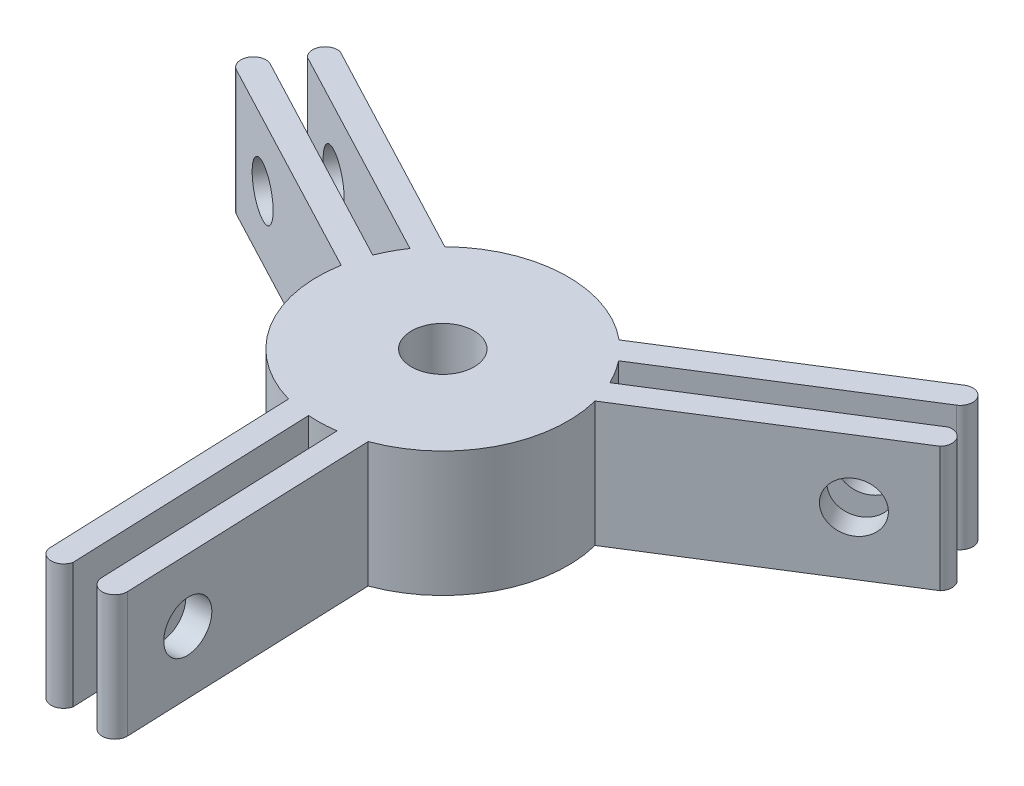
ISO-10303-21;
HEADER;
FILE_DESCRIPTION(('STEP AP214'),'2;1');
FILE_NAME('part.step','',(''),(''),'','','');
FILE_SCHEMA(('AUTOMOTIVE_DESIGN { 1 0 10303 214 1 1 1 1 }'));
ENDSEC;
DATA;
#1=APPLICATION_CONTEXT('core data for automotive mechanical design processes');
#2=APPLICATION_PROTOCOL_DEFINITION('international standard','automotive_design',2000,#1);
#3=PRODUCT_CONTEXT('',#1,'mechanical');
#4=PRODUCT('Part','Part','',(#3));
#5=PRODUCT_RELATED_PRODUCT_CATEGORY('part','',(#4));
#6=PRODUCT_DEFINITION_FORMATION('','',#4);
#7=PRODUCT_DEFINITION_CONTEXT('part definition',#1,'design');
#8=PRODUCT_DEFINITION('design','',#6,#7);
#9=PRODUCT_DEFINITION_SHAPE('','',#8);
#10=(LENGTH_UNIT() NAMED_UNIT(*) SI_UNIT(.MILLI.,.METRE.));
#11=(NAMED_UNIT(*) PLANE_ANGLE_UNIT() SI_UNIT($,.RADIAN.));
#12=(NAMED_UNIT(*) SI_UNIT($,.STERADIAN.) SOLID_ANGLE_UNIT());
#13=UNCERTAINTY_MEASURE_WITH_UNIT(LENGTH_MEASURE(1.E-05),#10,'distance_accuracy_value','');
#14=(GEOMETRIC_REPRESENTATION_CONTEXT(3) GLOBAL_UNCERTAINTY_ASSIGNED_CONTEXT((#13)) GLOBAL_UNIT_ASSIGNED_CONTEXT((#10,
#11,#12)) REPRESENTATION_CONTEXT('',''));
#15=CARTESIAN_POINT('',(0.,0.,0.));
#16=DIRECTION('',(0.,0.,1.));
#17=DIRECTION('',(1.,0.,0.));
#18=AXIS2_PLACEMENT_3D('',#15,#16,#17);
#19=CARTESIAN_POINT('',(0.,10.,0.));
#20=DIRECTION('',(0.,1.,0.));
#21=DIRECTION('',(0.,0.,1.));
#22=AXIS2_PLACEMENT_3D('',#19,#20,#21);
#23=PLANE('',#22);
#24=CARTESIAN_POINT('',(0.,10.,0.));
#25=DIRECTION('',(0.,1.,0.));
#26=DIRECTION('',(0.,0.,1.));
#27=AXIS2_PLACEMENT_3D('',#24,#25,#26);
#28=CIRCLE('',#27,10.);
#29=CARTESIAN_POINT('',(9.01148587106745,10.,-4.33510350459499));
#30=VERTEX_POINT('',#29);
#31=CARTESIAN_POINT('',(7.84546468512186,10.,-6.20070027291319));
#32=VERTEX_POINT('',#31);
#33=EDGE_CURVE('E272',#30,#32,#28,.T.);
#34=ORIENTED_EDGE('',*,*,#33,.T.);
#35=DIRECTION('',(0.846174424298782,0.,-0.532906036429149));
#36=VECTOR('',#35,1.);
#37=CARTESIAN_POINT('',(7.84546468512186,10.,-6.20070027291319));
#38=LINE('',#37,#36);
#39=CARTESIAN_POINT('',(24.4096415204676,10.,-16.6325327303295));
#40=VERTEX_POINT('',#39);
#41=EDGE_CURVE('E140',#32,#40,#38,.T.);
#42=ORIENTED_EDGE('',*,*,#41,.T.);
#43=CARTESIAN_POINT('',(23.8767354840384,10.,-17.4787071546283));
#44=DIRECTION('',(0.,1.,0.));
#45=DIRECTION('',(0.,0.,1.));
#46=AXIS2_PLACEMENT_3D('',#43,#44,#45);
#47=CIRCLE('',#46,1.);
#48=CARTESIAN_POINT('',(23.3438294476093,10.,-18.3248815789271));
#49=VERTEX_POINT('',#48);
#50=EDGE_CURVE('E335',#40,#49,#47,.T.);
#51=ORIENTED_EDGE('',*,*,#50,.T.);
#52=DIRECTION('',(-0.846174424298782,0.,0.532906036429149));
#53=VECTOR('',#52,1.);
#54=CARTESIAN_POINT('',(6.42034096163365,10.,-7.6667608503441));
#55=LINE('',#54,#53);
#56=CARTESIAN_POINT('',(6.42034096163365,10.,-7.6667608503441));
#57=VERTEX_POINT('',#56);
#58=EDGE_CURVE('E354',#49,#57,#55,.T.);
#59=ORIENTED_EDGE('',*,*,#58,.T.);
#60=CARTESIAN_POINT('',(0.,10.,0.));
#61=DIRECTION('',(0.,1.,0.));
#62=DIRECTION('',(0.,0.,1.));
#63=AXIS2_PLACEMENT_3D('',#60,#61,#62);
#64=CIRCLE('',#63,10.);
#65=CARTESIAN_POINT('',(-6.99010809505121,10.,-7.15111101993945));
#66=VERTEX_POINT('',#65);
#67=EDGE_CURVE('E351',#57,#66,#64,.T.);
#68=ORIENTED_EDGE('',*,*,#67,.T.);
#69=DIRECTION('',(-0.88459737752711,0.,-0.466355529260842));
#70=VECTOR('',#69,1.);
#71=CARTESIAN_POINT('',(-6.99010809505122,10.,-7.15111101993945));
#72=LINE('',#71,#70);
#73=CARTESIAN_POINT('',(-24.6820556455925,10.,-16.4782216051558));
#74=VERTEX_POINT('',#73);
#75=EDGE_CURVE('E353',#66,#74,#72,.T.);
#76=ORIENTED_EDGE('',*,*,#75,.T.);
#77=CARTESIAN_POINT('',(-24.9037683563406,10.,-15.5031095736985));
#78=DIRECTION('',(0.,1.,0.));
#79=DIRECTION('',(0.,0.,-1.));
#80=AXIS2_PLACEMENT_3D('',#77,#78,#79);
#81=CIRCLE('',#80,1.);
#82=CARTESIAN_POINT('',(-25.5830344696015,10.,-14.7692175193912));
#83=VERTEX_POINT('',#82);
#84=EDGE_CURVE('E356',#74,#83,#81,.T.);
#85=ORIENTED_EDGE('',*,*,#84,.T.);
#86=DIRECTION('',(0.88459737752711,0.,0.466355529260842));
#87=VECTOR('',#86,1.);
#88=CARTESIAN_POINT('',(-8.26005269854793,10.,-5.63662393789146));
#89=LINE('',#88,#87);
#90=CARTESIAN_POINT('',(-8.26005269854793,10.,-5.63662393789146));
#91=VERTEX_POINT('',#90);
#92=EDGE_CURVE('E362',#83,#91,#89,.T.);
#93=ORIENTED_EDGE('',*,*,#92,.T.);
#94=CARTESIAN_POINT('',(0.,10.,0.));
#95=DIRECTION('',(0.,1.,0.));
#96=DIRECTION('',(0.,0.,1.));
#97=AXIS2_PLACEMENT_3D('',#94,#95,#96);
#98=CIRCLE('',#97,10.);
#99=CARTESIAN_POINT('',(-9.29269630015686,10.,-3.69402158535262));
#100=VERTEX_POINT('',#99);
#101=EDGE_CURVE('E364',#91,#100,#98,.T.);
#102=ORIENTED_EDGE('',*,*,#101,.T.);
#103=DIRECTION('',(-0.88459737752711,0.,-0.466355529260842));
#104=VECTOR('',#103,1.);
#105=CARTESIAN_POINT('',(-9.29269630015686,10.,-3.69402158535262));
#106=LINE('',#105,#104);
#107=CARTESIAN_POINT('',(-26.6090166339753,10.,-12.8231032888316));
#108=VERTEX_POINT('',#107);
#109=EDGE_CURVE('E366',#100,#108,#106,.T.);
#110=ORIENTED_EDGE('',*,*,#109,.T.);
#111=CARTESIAN_POINT('',(-27.0753721632362,10.,-11.9385059113045));
#112=DIRECTION('',(0.,1.,0.));
#113=DIRECTION('',(0.,0.,1.));
#114=AXIS2_PLACEMENT_3D('',#111,#112,#113);
#115=CIRCLE('',#114,1.);
#116=CARTESIAN_POINT('',(-27.541727692497,10.,-11.0539085337773));
#117=VERTEX_POINT('',#116);
#118=EDGE_CURVE('E368',#108,#117,#115,.T.);
#119=ORIENTED_EDGE('',*,*,#118,.T.);
#120=DIRECTION('',(0.88459737752711,0.,0.466355529260842));
#121=VECTOR('',#120,1.);
#122=CARTESIAN_POINT('',(-9.8497801419548,10.,-1.7267979485605));
#123=LINE('',#122,#121);
#124=CARTESIAN_POINT('',(-9.8497801419548,10.,-1.7267979485605));
#125=VERTEX_POINT('',#124);
#126=EDGE_CURVE('E370',#117,#125,#123,.T.);
#127=ORIENTED_EDGE('',*,*,#126,.T.);
#128=CARTESIAN_POINT('',(0.,10.,0.));
#129=DIRECTION('',(0.,1.,0.));
#130=DIRECTION('',(0.,0.,1.));
#131=AXIS2_PLACEMENT_3D('',#128,#129,#130);
#132=CIRCLE('',#131,10.);
#133=CARTESIAN_POINT('',(-2.69798976102481,10.,9.62916669548333));
#134=VERTEX_POINT('',#133);
#135=EDGE_CURVE('E372',#125,#134,#132,.T.);
#136=ORIENTED_EDGE('',*,*,#135,.T.);
#137=DIRECTION('',(0.0384229532283287,0.,0.999261565689992));
#138=VECTOR('',#137,1.);
#139=CARTESIAN_POINT('',(-2.69798976102481,10.,9.62916669548333));
#140=LINE('',#139,#138);
#141=CARTESIAN_POINT('',(-1.92953069645827,10.,29.6143980092821));
#142=VERTEX_POINT('',#141);
#143=EDGE_CURVE('E374',#134,#142,#140,.T.);
#144=ORIENTED_EDGE('',*,*,#143,.T.);
#145=CARTESIAN_POINT('',(-0.974202550306361,10.,29.3188508334032));
#146=DIRECTION('',(0.,1.,0.));
#147=DIRECTION('',(0.,0.,-1.));
#148=AXIS2_PLACEMENT_3D('',#145,#146,#147);
#149=CIRCLE('',#148,0.999999999999999);
#150=CARTESIAN_POINT('',(0.000999668989778838,10.,29.5401665162634));
#151=VERTEX_POINT('',#150);
#152=EDGE_CURVE('E376',#142,#151,#149,.T.);
#153=ORIENTED_EDGE('',*,*,#152,.T.);
#154=DIRECTION('',(-0.0384229532283282,0.,-0.999261565689992));
#155=VECTOR('',#154,1.);
#156=CARTESIAN_POINT('',(-0.751433172519515,10.,9.97172744248644));
#157=LINE('',#156,#155);
#158=CARTESIAN_POINT('',(-0.751433172519515,10.,9.97172744248644));
#159=VERTEX_POINT('',#158);
#160=EDGE_CURVE('E378',#151,#159,#157,.T.);
#161=ORIENTED_EDGE('',*,*,#160,.T.);
#162=CARTESIAN_POINT('',(0.,10.,0.));
#163=DIRECTION('',(0.,1.,0.));
#164=DIRECTION('',(0.,0.,1.));
#165=AXIS2_PLACEMENT_3D('',#162,#163,#164);
#166=CIRCLE('',#165,10.);
#167=CARTESIAN_POINT('',(1.44723161503499,10.,9.89472185826581));
#168=VERTEX_POINT('',#167);
#169=EDGE_CURVE('E380',#159,#168,#166,.T.);
#170=ORIENTED_EDGE('',*,*,#169,.T.);
#171=DIRECTION('',(0.0384229532283283,0.,0.999261565689992));
#172=VECTOR('',#171,1.);
#173=CARTESIAN_POINT('',(1.44723161503499,10.,9.89472185826581));
#174=LINE('',#173,#172);
#175=CARTESIAN_POINT('',(2.19937511350774,10.,29.4556360191611));
#176=VERTEX_POINT('',#175);
#177=EDGE_CURVE('E382',#168,#176,#174,.T.);
#178=ORIENTED_EDGE('',*,*,#177,.T.);
#179=CARTESIAN_POINT('',(3.19863667919775,10.,29.4172130659328));
#180=DIRECTION('',(0.,1.,0.));
#181=DIRECTION('',(0.,0.,1.));
#182=AXIS2_PLACEMENT_3D('',#179,#180,#181);
#183=CIRCLE('',#182,1.);
#184=CARTESIAN_POINT('',(4.19789824488775,10.,29.3787901127044));
#185=VERTEX_POINT('',#184);
#186=EDGE_CURVE('E384',#176,#185,#183,.T.);
#187=ORIENTED_EDGE('',*,*,#186,.T.);
#188=DIRECTION('',(-0.0384229532283283,0.,-0.999261565689992));
#189=VECTOR('',#188,1.);
#190=CARTESIAN_POINT('',(3.42943918032116,10.,9.3935587989046));
#191=LINE('',#190,#189);
#192=CARTESIAN_POINT('',(3.42943918032116,10.,9.3935587989046));
#193=VERTEX_POINT('',#192);
#194=EDGE_CURVE('E386',#185,#193,#191,.T.);
#195=ORIENTED_EDGE('',*,*,#194,.T.);
#196=CARTESIAN_POINT('',(0.,10.,0.));
#197=DIRECTION('',(0.,1.,0.));
#198=DIRECTION('',(0.,0.,1.));
#199=AXIS2_PLACEMENT_3D('',#196,#197,#198);
#200=CIRCLE('',#199,10.);
#201=CARTESIAN_POINT('',(9.68809785607602,10.,-2.47805567554387));
#202=VERTEX_POINT('',#201);
#203=EDGE_CURVE('E207',#193,#202,#200,.T.);
#204=ORIENTED_EDGE('',*,*,#203,.T.);
#205=DIRECTION('',(0.846174424298781,0.,-0.53290603642915));
#206=VECTOR('',#205,1.);
#207=CARTESIAN_POINT('',(9.68809785607602,10.,-2.47805567554387));
#208=LINE('',#207,#206);
#209=CARTESIAN_POINT('',(26.6115863420508,10.,-13.1361764041263));
#210=VERTEX_POINT('',#209);
#211=EDGE_CURVE('E201',#202,#210,#208,.T.);
#212=ORIENTED_EDGE('',*,*,#211,.T.);
#213=CARTESIAN_POINT('',(25.8779709066469,10.,-13.8157412597047));
#214=DIRECTION('',(0.,1.,0.));
#215=DIRECTION('',(0.,0.,-1.));
#216=AXIS2_PLACEMENT_3D('',#213,#214,#215);
#217=CIRCLE('',#216,1.);
#218=CARTESIAN_POINT('',(25.5820348006117,10.,-14.7709489968722));
#219=VERTEX_POINT('',#218);
#220=EDGE_CURVE('E205',#210,#219,#217,.T.);
#221=ORIENTED_EDGE('',*,*,#220,.T.);
#222=DIRECTION('',(-0.846174424298781,0.,0.532906036429149));
#223=VECTOR('',#222,1.);
#224=CARTESIAN_POINT('',(9.01148587106745,10.,-4.33510350459499));
#225=LINE('',#224,#223);
#226=EDGE_CURVE('E49',#219,#30,#225,.T.);
#227=ORIENTED_EDGE('',*,*,#226,.T.);
#228=EDGE_LOOP('',(#34,#42,#51,#59,#68,#76,#85,#93,#102,#110,#119,#127,#136,#144,#153,#161,#170,
#178,#187,#195,#204,#212,#221,#227));
#229=FACE_BOUND('',#228,.T.);
#230=CARTESIAN_POINT('',(0.,10.,0.));
#231=DIRECTION('',(0.,1.,0.));
#232=DIRECTION('',(0.,0.,1.));
#233=AXIS2_PLACEMENT_3D('',#230,#231,#232);
#234=CIRCLE('',#233,2.5);
#235=CARTESIAN_POINT('',(0.,10.,2.5));
#236=VERTEX_POINT('',#235);
#237=EDGE_CURVE('E229',#236,#236,#234,.T.);
#238=ORIENTED_EDGE('',*,*,#237,.F.);
#239=EDGE_LOOP('',(#238));
#240=FACE_BOUND('',#239,.T.);
#241=ADVANCED_FACE('F32',(#229,#240),#23,.T.);
#242=CARTESIAN_POINT('',(0.,0.,0.));
#243=DIRECTION('',(0.,1.,0.));
#244=DIRECTION('',(0.,0.,1.));
#245=AXIS2_PLACEMENT_3D('',#242,#243,#244);
#246=PLANE('',#245);
#247=CARTESIAN_POINT('',(0.,0.,0.));
#248=DIRECTION('',(0.,1.,0.));
#249=DIRECTION('',(0.,0.,1.));
#250=AXIS2_PLACEMENT_3D('',#247,#248,#249);
#251=CIRCLE('',#250,10.);
#252=CARTESIAN_POINT('',(9.01148587106745,0.,-4.33510350459499));
#253=VERTEX_POINT('',#252);
#254=CARTESIAN_POINT('',(7.84546468512186,0.,-6.20070027291319));
#255=VERTEX_POINT('',#254);
#256=EDGE_CURVE('E225',#253,#255,#251,.T.);
#257=ORIENTED_EDGE('',*,*,#256,.F.);
#258=DIRECTION('',(-0.846174424298781,0.,0.532906036429149));
#259=VECTOR('',#258,1.);
#260=CARTESIAN_POINT('',(9.01148587106745,0.,-4.33510350459499));
#261=LINE('',#260,#259);
#262=CARTESIAN_POINT('',(25.5820348006117,0.,-14.7709489968722));
#263=VERTEX_POINT('',#262);
#264=EDGE_CURVE('E132',#263,#253,#261,.T.);
#265=ORIENTED_EDGE('',*,*,#264,.F.);
#266=CARTESIAN_POINT('',(25.8779709066469,0.,-13.8157412597047));
#267=DIRECTION('',(0.,1.,0.));
#268=DIRECTION('',(0.,0.,-1.));
#269=AXIS2_PLACEMENT_3D('',#266,#267,#268);
#270=CIRCLE('',#269,1.);
#271=CARTESIAN_POINT('',(26.6115863420508,0.,-13.1361764041263));
#272=VERTEX_POINT('',#271);
#273=EDGE_CURVE('E126',#272,#263,#270,.T.);
#274=ORIENTED_EDGE('',*,*,#273,.F.);
#275=DIRECTION('',(0.846174424298781,0.,-0.53290603642915));
#276=VECTOR('',#275,1.);
#277=CARTESIAN_POINT('',(9.68809785607602,0.,-2.47805567554387));
#278=LINE('',#277,#276);
#279=CARTESIAN_POINT('',(9.68809785607602,0.,-2.47805567554387));
#280=VERTEX_POINT('',#279);
#281=EDGE_CURVE('E215',#280,#272,#278,.T.);
#282=ORIENTED_EDGE('',*,*,#281,.F.);
#283=CARTESIAN_POINT('',(0.,0.,0.));
#284=DIRECTION('',(0.,1.,0.));
#285=DIRECTION('',(0.,0.,1.));
#286=AXIS2_PLACEMENT_3D('',#283,#284,#285);
#287=CIRCLE('',#286,10.);
#288=CARTESIAN_POINT('',(3.42943918032116,0.,9.3935587989046));
#289=VERTEX_POINT('',#288);
#290=EDGE_CURVE('E267',#289,#280,#287,.T.);
#291=ORIENTED_EDGE('',*,*,#290,.F.);
#292=DIRECTION('',(-0.0384229532283283,0.,-0.999261565689992));
#293=VECTOR('',#292,1.);
#294=CARTESIAN_POINT('',(3.42943918032116,0.,9.3935587989046));
#295=LINE('',#294,#293);
#296=CARTESIAN_POINT('',(4.19789824488775,0.,29.3787901127044));
#297=VERTEX_POINT('',#296);
#298=EDGE_CURVE('E265',#297,#289,#295,.T.);
#299=ORIENTED_EDGE('',*,*,#298,.F.);
#300=CARTESIAN_POINT('',(3.19863667919775,0.,29.4172130659328));
#301=DIRECTION('',(0.,1.,0.));
#302=DIRECTION('',(0.,0.,1.));
#303=AXIS2_PLACEMENT_3D('',#300,#301,#302);
#304=CIRCLE('',#303,1.);
#305=CARTESIAN_POINT('',(2.19937511350774,0.,29.4556360191611));
#306=VERTEX_POINT('',#305);
#307=EDGE_CURVE('E263',#306,#297,#304,.T.);
#308=ORIENTED_EDGE('',*,*,#307,.F.);
#309=DIRECTION('',(0.0384229532283283,0.,0.999261565689992));
#310=VECTOR('',#309,1.);
#311=CARTESIAN_POINT('',(1.44723161503499,0.,9.89472185826581));
#312=LINE('',#311,#310);
#313=CARTESIAN_POINT('',(1.44723161503499,0.,9.89472185826581));
#314=VERTEX_POINT('',#313);
#315=EDGE_CURVE('E261',#314,#306,#312,.T.);
#316=ORIENTED_EDGE('',*,*,#315,.F.);
#317=CARTESIAN_POINT('',(0.,0.,0.));
#318=DIRECTION('',(0.,1.,0.));
#319=DIRECTION('',(0.,0.,1.));
#320=AXIS2_PLACEMENT_3D('',#317,#318,#319);
#321=CIRCLE('',#320,10.);
#322=CARTESIAN_POINT('',(-0.751433172519515,0.,9.97172744248644));
#323=VERTEX_POINT('',#322);
#324=EDGE_CURVE('E259',#323,#314,#321,.T.);
#325=ORIENTED_EDGE('',*,*,#324,.F.);
#326=DIRECTION('',(-0.0384229532283282,0.,-0.999261565689992));
#327=VECTOR('',#326,1.);
#328=CARTESIAN_POINT('',(-0.751433172519515,0.,9.97172744248644));
#329=LINE('',#328,#327);
#330=CARTESIAN_POINT('',(0.000999668989778838,0.,29.5401665162634));
#331=VERTEX_POINT('',#330);
#332=EDGE_CURVE('E257',#331,#323,#329,.T.);
#333=ORIENTED_EDGE('',*,*,#332,.F.);
#334=CARTESIAN_POINT('',(-0.974202550306361,0.,29.3188508334032));
#335=DIRECTION('',(0.,1.,0.));
#336=DIRECTION('',(0.,0.,-1.));
#337=AXIS2_PLACEMENT_3D('',#334,#335,#336);
#338=CIRCLE('',#337,0.999999999999999);
#339=CARTESIAN_POINT('',(-1.92953069645827,0.,29.6143980092821));
#340=VERTEX_POINT('',#339);
#341=EDGE_CURVE('E255',#340,#331,#338,.T.);
#342=ORIENTED_EDGE('',*,*,#341,.F.);
#343=DIRECTION('',(0.0384229532283287,0.,0.999261565689992));
#344=VECTOR('',#343,1.);
#345=CARTESIAN_POINT('',(-2.69798976102481,0.,9.62916669548333));
#346=LINE('',#345,#344);
#347=CARTESIAN_POINT('',(-2.69798976102481,0.,9.62916669548333));
#348=VERTEX_POINT('',#347);
#349=EDGE_CURVE('E253',#348,#340,#346,.T.);
#350=ORIENTED_EDGE('',*,*,#349,.F.);
#351=CARTESIAN_POINT('',(0.,0.,0.));
#352=DIRECTION('',(0.,1.,0.));
#353=DIRECTION('',(0.,0.,1.));
#354=AXIS2_PLACEMENT_3D('',#351,#352,#353);
#355=CIRCLE('',#354,10.);
#356=CARTESIAN_POINT('',(-9.8497801419548,0.,-1.7267979485605));
#357=VERTEX_POINT('',#356);
#358=EDGE_CURVE('E251',#357,#348,#355,.T.);
#359=ORIENTED_EDGE('',*,*,#358,.F.);
#360=DIRECTION('',(0.88459737752711,0.,0.466355529260842));
#361=VECTOR('',#360,1.);
#362=CARTESIAN_POINT('',(-9.8497801419548,0.,-1.7267979485605));
#363=LINE('',#362,#361);
#364=CARTESIAN_POINT('',(-27.541727692497,0.,-11.0539085337773));
#365=VERTEX_POINT('',#364);
#366=EDGE_CURVE('E249',#365,#357,#363,.T.);
#367=ORIENTED_EDGE('',*,*,#366,.F.);
#368=CARTESIAN_POINT('',(-27.0753721632362,0.,-11.9385059113045));
#369=DIRECTION('',(0.,1.,0.));
#370=DIRECTION('',(0.,0.,1.));
#371=AXIS2_PLACEMENT_3D('',#368,#369,#370);
#372=CIRCLE('',#371,1.);
#373=CARTESIAN_POINT('',(-26.6090166339753,0.,-12.8231032888316));
#374=VERTEX_POINT('',#373);
#375=EDGE_CURVE('E247',#374,#365,#372,.T.);
#376=ORIENTED_EDGE('',*,*,#375,.F.);
#377=DIRECTION('',(-0.88459737752711,0.,-0.466355529260842));
#378=VECTOR('',#377,1.);
#379=CARTESIAN_POINT('',(-9.29269630015686,0.,-3.69402158535262));
#380=LINE('',#379,#378);
#381=CARTESIAN_POINT('',(-9.29269630015686,0.,-3.69402158535262));
#382=VERTEX_POINT('',#381);
#383=EDGE_CURVE('E245',#382,#374,#380,.T.);
#384=ORIENTED_EDGE('',*,*,#383,.F.);
#385=CARTESIAN_POINT('',(0.,0.,0.));
#386=DIRECTION('',(0.,1.,0.));
#387=DIRECTION('',(0.,0.,1.));
#388=AXIS2_PLACEMENT_3D('',#385,#386,#387);
#389=CIRCLE('',#388,10.);
#390=CARTESIAN_POINT('',(-8.26005269854793,0.,-5.63662393789146));
#391=VERTEX_POINT('',#390);
#392=EDGE_CURVE('E243',#391,#382,#389,.T.);
#393=ORIENTED_EDGE('',*,*,#392,.F.);
#394=DIRECTION('',(0.88459737752711,0.,0.466355529260842));
#395=VECTOR('',#394,1.);
#396=CARTESIAN_POINT('',(-8.26005269854793,0.,-5.63662393789146));
#397=LINE('',#396,#395);
#398=CARTESIAN_POINT('',(-25.5830344696015,0.,-14.7692175193912));
#399=VERTEX_POINT('',#398);
#400=EDGE_CURVE('E241',#399,#391,#397,.T.);
#401=ORIENTED_EDGE('',*,*,#400,.F.);
#402=CARTESIAN_POINT('',(-24.9037683563406,0.,-15.5031095736985));
#403=DIRECTION('',(0.,1.,0.));
#404=DIRECTION('',(0.,0.,-1.));
#405=AXIS2_PLACEMENT_3D('',#402,#403,#404);
#406=CIRCLE('',#405,1.);
#407=CARTESIAN_POINT('',(-24.6820556455925,0.,-16.4782216051558));
#408=VERTEX_POINT('',#407);
#409=EDGE_CURVE('E239',#408,#399,#406,.T.);
#410=ORIENTED_EDGE('',*,*,#409,.F.);
#411=DIRECTION('',(-0.88459737752711,0.,-0.466355529260842));
#412=VECTOR('',#411,1.);
#413=CARTESIAN_POINT('',(-6.99010809505122,0.,-7.15111101993945));
#414=LINE('',#413,#412);
#415=CARTESIAN_POINT('',(-6.99010809505121,0.,-7.15111101993945));
#416=VERTEX_POINT('',#415);
#417=EDGE_CURVE('E237',#416,#408,#414,.T.);
#418=ORIENTED_EDGE('',*,*,#417,.F.);
#419=CARTESIAN_POINT('',(0.,0.,0.));
#420=DIRECTION('',(0.,1.,0.));
#421=DIRECTION('',(0.,0.,1.));
#422=AXIS2_PLACEMENT_3D('',#419,#420,#421);
#423=CIRCLE('',#422,10.);
#424=CARTESIAN_POINT('',(6.42034096163365,0.,-7.6667608503441));
#425=VERTEX_POINT('',#424);
#426=EDGE_CURVE('E235',#425,#416,#423,.T.);
#427=ORIENTED_EDGE('',*,*,#426,.F.);
#428=DIRECTION('',(-0.846174424298782,0.,0.532906036429149));
#429=VECTOR('',#428,1.);
#430=CARTESIAN_POINT('',(6.42034096163365,0.,-7.6667608503441));
#431=LINE('',#430,#429);
#432=CARTESIAN_POINT('',(23.3438294476093,0.,-18.3248815789271));
#433=VERTEX_POINT('',#432);
#434=EDGE_CURVE('E233',#433,#425,#431,.T.);
#435=ORIENTED_EDGE('',*,*,#434,.F.);
#436=CARTESIAN_POINT('',(23.8767354840384,0.,-17.4787071546283));
#437=DIRECTION('',(0.,1.,0.));
#438=DIRECTION('',(0.,0.,1.));
#439=AXIS2_PLACEMENT_3D('',#436,#437,#438);
#440=CIRCLE('',#439,1.);
#441=CARTESIAN_POINT('',(24.4096415204676,0.,-16.6325327303295));
#442=VERTEX_POINT('',#441);
#443=EDGE_CURVE('E231',#442,#433,#440,.T.);
#444=ORIENTED_EDGE('',*,*,#443,.F.);
#445=DIRECTION('',(0.846174424298782,0.,-0.532906036429149));
#446=VECTOR('',#445,1.);
#447=CARTESIAN_POINT('',(7.84546468512186,0.,-6.20070027291319));
#448=LINE('',#447,#446);
#449=EDGE_CURVE('E228',#255,#442,#448,.T.);
#450=ORIENTED_EDGE('',*,*,#449,.F.);
#451=EDGE_LOOP('',(#257,#265,#274,#282,#291,#299,#308,#316,#325,#333,#342,#350,#359,#367,#376,
#384,#393,#401,#410,#418,#427,#435,#444,#450));
#452=FACE_BOUND('',#451,.T.);
#453=CARTESIAN_POINT('',(0.,0.,0.));
#454=DIRECTION('',(0.,1.,0.));
#455=DIRECTION('',(0.,0.,1.));
#456=AXIS2_PLACEMENT_3D('',#453,#454,#455);
#457=CIRCLE('',#456,2.5);
#458=CARTESIAN_POINT('',(0.,0.,2.5));
#459=VERTEX_POINT('',#458);
#460=EDGE_CURVE('E482',#459,#459,#457,.T.);
#461=ORIENTED_EDGE('',*,*,#460,.T.);
#462=EDGE_LOOP('',(#461));
#463=FACE_BOUND('',#462,.T.);
#464=ADVANCED_FACE('F339',(#452,#463),#246,.F.);
#465=CARTESIAN_POINT('',(0.,10.,0.));
#466=DIRECTION('',(0.,-1.,0.));
#467=DIRECTION('',(0.,0.,-1.));
#468=AXIS2_PLACEMENT_3D('',#465,#466,#467);
#469=CYLINDRICAL_SURFACE('',#468,10.);
#470=ORIENTED_EDGE('',*,*,#256,.T.);
#471=DIRECTION('',(0.,-1.,0.));
#472=VECTOR('',#471,1.);
#473=CARTESIAN_POINT('',(7.84546468512186,10.,-6.20070027291319));
#474=LINE('',#473,#472);
#475=EDGE_CURVE('E11',#32,#255,#474,.T.);
#476=ORIENTED_EDGE('',*,*,#475,.F.);
#477=ORIENTED_EDGE('',*,*,#33,.F.);
#478=DIRECTION('',(0.,-1.,0.));
#479=VECTOR('',#478,1.);
#480=CARTESIAN_POINT('',(9.01148587106745,10.,-4.33510350459499));
#481=LINE('',#480,#479);
#482=EDGE_CURVE('E221',#30,#253,#481,.T.);
#483=ORIENTED_EDGE('',*,*,#482,.T.);
#484=EDGE_LOOP('',(#470,#476,#477,#483));
#485=FACE_BOUND('',#484,.T.);
#486=ADVANCED_FACE('F34',(#485),#469,.T.);
#487=CARTESIAN_POINT('',(7.84546468512186,10.,-6.20070027291319));
#488=DIRECTION('',(-0.532906036429149,0.,-0.846174424298782));
#489=DIRECTION('',(-0.846174424298782,0.,0.532906036429149));
#490=AXIS2_PLACEMENT_3D('',#487,#488,#489);
#491=PLANE('',#490);
#492=CARTESIAN_POINT('',(20.1787693989738,5.,-13.9680025481836));
#493=DIRECTION('',(-0.532906036429142,0.,-0.846174424298786));
#494=DIRECTION('',(-0.846174424298786,0.,0.532906036429142));
#495=AXIS2_PLACEMENT_3D('',#492,#493,#494);
#496=CIRCLE('',#495,2.);
#497=CARTESIAN_POINT('',(18.4864205503762,5.,-12.9021904753253));
#498=VERTEX_POINT('',#497);
#499=EDGE_CURVE('E448',#498,#498,#496,.T.);
#500=ORIENTED_EDGE('',*,*,#499,.T.);
#501=EDGE_LOOP('',(#500));
#502=FACE_BOUND('',#501,.T.);
#503=ORIENTED_EDGE('',*,*,#449,.T.);
#504=DIRECTION('',(0.,-1.,0.));
#505=VECTOR('',#504,1.);
#506=CARTESIAN_POINT('',(24.4096415204676,10.,-16.6325327303295));
#507=LINE('',#506,#505);
#508=EDGE_CURVE('E41',#40,#442,#507,.T.);
#509=ORIENTED_EDGE('',*,*,#508,.F.);
#510=ORIENTED_EDGE('',*,*,#41,.F.);
#511=ORIENTED_EDGE('',*,*,#475,.T.);
#512=EDGE_LOOP('',(#503,#509,#510,#511));
#513=FACE_BOUND('',#512,.T.);
#514=ADVANCED_FACE('F572',(#502,#513),#491,.F.);
#515=CARTESIAN_POINT('',(23.8767354840384,10.,-17.4787071546283));
#516=DIRECTION('',(0.,-1.,0.));
#517=DIRECTION('',(0.,0.,-1.));
#518=AXIS2_PLACEMENT_3D('',#515,#516,#517);
#519=CYLINDRICAL_SURFACE('',#518,1.);
#520=ORIENTED_EDGE('',*,*,#443,.T.);
#521=DIRECTION('',(0.,-1.,0.));
#522=VECTOR('',#521,1.);
#523=CARTESIAN_POINT('',(23.3438294476093,10.,-18.3248815789271));
#524=LINE('',#523,#522);
#525=EDGE_CURVE('E327',#49,#433,#524,.T.);
#526=ORIENTED_EDGE('',*,*,#525,.F.);
#527=ORIENTED_EDGE('',*,*,#50,.F.);
#528=ORIENTED_EDGE('',*,*,#508,.T.);
#529=EDGE_LOOP('',(#520,#526,#527,#528));
#530=FACE_BOUND('',#529,.T.);
#531=ADVANCED_FACE('F333',(#530),#519,.T.);
#532=CARTESIAN_POINT('',(6.42034096163365,10.,-7.6667608503441));
#533=DIRECTION('',(0.532906036429149,0.,0.846174424298782));
#534=DIRECTION('',(0.846174424298782,0.,-0.532906036429149));
#535=AXIS2_PLACEMENT_3D('',#532,#533,#534);
#536=PLANE('',#535);
#537=CARTESIAN_POINT('',(19.1129573261155,5.,-15.6603513967812));
#538=DIRECTION('',(-0.532906036429142,0.,-0.846174424298786));
#539=DIRECTION('',(-0.846174424298786,0.,0.532906036429142));
#540=AXIS2_PLACEMENT_3D('',#537,#538,#539);
#541=CIRCLE('',#540,2.);
#542=CARTESIAN_POINT('',(17.4206084775179,5.,-14.5945393239229));
#543=VERTEX_POINT('',#542);
#544=EDGE_CURVE('E445',#543,#543,#541,.T.);
#545=ORIENTED_EDGE('',*,*,#544,.F.);
#546=EDGE_LOOP('',(#545));
#547=FACE_BOUND('',#546,.T.);
#548=ORIENTED_EDGE('',*,*,#434,.T.);
#549=DIRECTION('',(0.,-1.,0.));
#550=VECTOR('',#549,1.);
#551=CARTESIAN_POINT('',(6.42034096163365,10.,-7.6667608503441));
#552=LINE('',#551,#550);
#553=EDGE_CURVE('E324',#57,#425,#552,.T.);
#554=ORIENTED_EDGE('',*,*,#553,.F.);
#555=ORIENTED_EDGE('',*,*,#58,.F.);
#556=ORIENTED_EDGE('',*,*,#525,.T.);
#557=EDGE_LOOP('',(#548,#554,#555,#556));
#558=FACE_BOUND('',#557,.T.);
#559=ADVANCED_FACE('F345',(#547,#558),#536,.F.);
#560=CARTESIAN_POINT('',(0.,10.,0.));
#561=DIRECTION('',(0.,-1.,0.));
#562=DIRECTION('',(0.,0.,-1.));
#563=AXIS2_PLACEMENT_3D('',#560,#561,#562);
#564=CYLINDRICAL_SURFACE('',#563,10.);
#565=ORIENTED_EDGE('',*,*,#426,.T.);
#566=DIRECTION('',(0.,-1.,0.));
#567=VECTOR('',#566,1.);
#568=CARTESIAN_POINT('',(-6.99010809505121,10.,-7.15111101993945));
#569=LINE('',#568,#567);
#570=EDGE_CURVE('E321',#66,#416,#569,.T.);
#571=ORIENTED_EDGE('',*,*,#570,.F.);
#572=ORIENTED_EDGE('',*,*,#67,.F.);
#573=ORIENTED_EDGE('',*,*,#553,.T.);
#574=EDGE_LOOP('',(#565,#571,#572,#573));
#575=FACE_BOUND('',#574,.T.);
#576=ADVANCED_FACE('F349',(#575),#564,.T.);
#577=CARTESIAN_POINT('',(-6.99010809505122,10.,-7.15111101993945));
#578=DIRECTION('',(-0.466355529260842,0.,0.88459737752711));
#579=DIRECTION('',(0.88459737752711,0.,0.466355529260842));
#580=AXIS2_PLACEMENT_3D('',#577,#578,#579);
#581=PLANE('',#580);
#582=CARTESIAN_POINT('',(-20.259068757957,5.,-14.1464439588517));
#583=DIRECTION('',(-0.466355529260846,0.,0.884597377527108));
#584=DIRECTION('',(0.884597377527108,0.,0.466355529260846));
#585=AXIS2_PLACEMENT_3D('',#582,#583,#584);
#586=CIRCLE('',#585,2.);
#587=CARTESIAN_POINT('',(-18.4898740029028,5.,-13.2137329003301));
#588=VERTEX_POINT('',#587);
#589=EDGE_CURVE('E467',#588,#588,#586,.T.);
#590=ORIENTED_EDGE('',*,*,#589,.T.);
#591=EDGE_LOOP('',(#590));
#592=FACE_BOUND('',#591,.T.);
#593=ORIENTED_EDGE('',*,*,#417,.T.);
#594=DIRECTION('',(0.,-1.,0.));
#595=VECTOR('',#594,1.);
#596=CARTESIAN_POINT('',(-24.6820556455925,10.,-16.4782216051558));
#597=LINE('',#596,#595);
#598=EDGE_CURVE('E318',#74,#408,#597,.T.);
#599=ORIENTED_EDGE('',*,*,#598,.F.);
#600=ORIENTED_EDGE('',*,*,#75,.F.);
#601=ORIENTED_EDGE('',*,*,#570,.T.);
#602=EDGE_LOOP('',(#593,#599,#600,#601));
#603=FACE_BOUND('',#602,.T.);
#604=ADVANCED_FACE('F556',(#592,#603),#581,.F.);
#605=CARTESIAN_POINT('',(-24.9037683563406,10.,-15.5031095736985));
#606=DIRECTION('',(0.,-1.,0.));
#607=DIRECTION('',(0.,0.,-1.));
#608=AXIS2_PLACEMENT_3D('',#605,#606,#607);
#609=CYLINDRICAL_SURFACE('',#608,1.);
#610=ORIENTED_EDGE('',*,*,#409,.T.);
#611=DIRECTION('',(0.,-1.,0.));
#612=VECTOR('',#611,1.);
#613=CARTESIAN_POINT('',(-25.5830344696015,10.,-14.7692175193912));
#614=LINE('',#613,#612);
#615=EDGE_CURVE('E315',#83,#399,#614,.T.);
#616=ORIENTED_EDGE('',*,*,#615,.F.);
#617=ORIENTED_EDGE('',*,*,#84,.F.);
#618=ORIENTED_EDGE('',*,*,#598,.T.);
#619=EDGE_LOOP('',(#610,#616,#617,#618));
#620=FACE_BOUND('',#619,.T.);
#621=ADVANCED_FACE('F553',(#620),#609,.T.);
#622=CARTESIAN_POINT('',(-8.26005269854793,10.,-5.63662393789146));
#623=DIRECTION('',(0.466355529260842,0.,-0.88459737752711));
#624=DIRECTION('',(-0.88459737752711,0.,-0.466355529260842));
#625=AXIS2_PLACEMENT_3D('',#622,#623,#624);
#626=PLANE('',#625);
#627=CARTESIAN_POINT('',(-21.1600475819659,5.,-12.4374398730871));
#628=DIRECTION('',(0.466355529260847,0.,-0.884597377527108));
#629=DIRECTION('',(-0.884597377527108,0.,-0.466355529260847));
#630=AXIS2_PLACEMENT_3D('',#627,#628,#629);
#631=CIRCLE('',#630,2.);
#632=CARTESIAN_POINT('',(-22.9292423370201,5.,-13.3701509316088));
#633=VERTEX_POINT('',#632);
#634=EDGE_CURVE('E464',#633,#633,#631,.T.);
#635=ORIENTED_EDGE('',*,*,#634,.T.);
#636=EDGE_LOOP('',(#635));
#637=FACE_BOUND('',#636,.T.);
#638=ORIENTED_EDGE('',*,*,#400,.T.);
#639=DIRECTION('',(0.,-1.,0.));
#640=VECTOR('',#639,1.);
#641=CARTESIAN_POINT('',(-8.26005269854793,10.,-5.63662393789146));
#642=LINE('',#641,#640);
#643=EDGE_CURVE('E312',#91,#391,#642,.T.);
#644=ORIENTED_EDGE('',*,*,#643,.F.);
#645=ORIENTED_EDGE('',*,*,#92,.F.);
#646=ORIENTED_EDGE('',*,*,#615,.T.);
#647=EDGE_LOOP('',(#638,#644,#645,#646));
#648=FACE_BOUND('',#647,.T.);
#649=ADVANCED_FACE('F549',(#637,#648),#626,.F.);
#650=CARTESIAN_POINT('',(0.,10.,0.));
#651=DIRECTION('',(0.,-1.,0.));
#652=DIRECTION('',(0.,0.,-1.));
#653=AXIS2_PLACEMENT_3D('',#650,#651,#652);
#654=CYLINDRICAL_SURFACE('',#653,10.);
#655=ORIENTED_EDGE('',*,*,#392,.T.);
#656=DIRECTION('',(0.,-1.,0.));
#657=VECTOR('',#656,1.);
#658=CARTESIAN_POINT('',(-9.29269630015686,10.,-3.69402158535262));
#659=LINE('',#658,#657);
#660=EDGE_CURVE('E309',#100,#382,#659,.T.);
#661=ORIENTED_EDGE('',*,*,#660,.F.);
#662=ORIENTED_EDGE('',*,*,#101,.F.);
#663=ORIENTED_EDGE('',*,*,#643,.T.);
#664=EDGE_LOOP('',(#655,#661,#662,#663));
#665=FACE_BOUND('',#664,.T.);
#666=ADVANCED_FACE('F544',(#665),#654,.T.);
#667=CARTESIAN_POINT('',(-9.29269630015686,10.,-3.69402158535262));
#668=DIRECTION('',(-0.466355529260842,0.,0.88459737752711));
#669=DIRECTION('',(0.88459737752711,0.,0.466355529260842));
#670=AXIS2_PLACEMENT_3D('',#667,#668,#669);
#671=PLANE('',#670);
#672=CARTESIAN_POINT('',(-22.1860297463397,5.,-10.4913256425275));
#673=DIRECTION('',(-0.466355529260846,0.,0.884597377527108));
#674=DIRECTION('',(0.884597377527108,0.,0.466355529260846));
#675=AXIS2_PLACEMENT_3D('',#672,#673,#674);
#676=CIRCLE('',#675,2.);
#677=CARTESIAN_POINT('',(-20.4168349912855,5.,-9.55861458400577));
#678=VERTEX_POINT('',#677);
#679=EDGE_CURVE('E453',#678,#678,#676,.T.);
#680=ORIENTED_EDGE('',*,*,#679,.T.);
#681=EDGE_LOOP('',(#680));
#682=FACE_BOUND('',#681,.T.);
#683=ORIENTED_EDGE('',*,*,#383,.T.);
#684=DIRECTION('',(0.,-1.,0.));
#685=VECTOR('',#684,1.);
#686=CARTESIAN_POINT('',(-26.6090166339753,10.,-12.8231032888316));
#687=LINE('',#686,#685);
#688=EDGE_CURVE('E306',#108,#374,#687,.T.);
#689=ORIENTED_EDGE('',*,*,#688,.F.);
#690=ORIENTED_EDGE('',*,*,#109,.F.);
#691=ORIENTED_EDGE('',*,*,#660,.T.);
#692=EDGE_LOOP('',(#683,#689,#690,#691));
#693=FACE_BOUND('',#692,.T.);
#694=ADVANCED_FACE('F538',(#682,#693),#671,.F.);
#695=CARTESIAN_POINT('',(-27.0753721632362,10.,-11.9385059113045));
#696=DIRECTION('',(0.,-1.,0.));
#697=DIRECTION('',(0.,0.,-1.));
#698=AXIS2_PLACEMENT_3D('',#695,#696,#697);
#699=CYLINDRICAL_SURFACE('',#698,1.);
#700=ORIENTED_EDGE('',*,*,#375,.T.);
#701=DIRECTION('',(0.,-1.,0.));
#702=VECTOR('',#701,1.);
#703=CARTESIAN_POINT('',(-27.541727692497,10.,-11.0539085337773));
#704=LINE('',#703,#702);
#705=EDGE_CURVE('E303',#117,#365,#704,.T.);
#706=ORIENTED_EDGE('',*,*,#705,.F.);
#707=ORIENTED_EDGE('',*,*,#118,.F.);
#708=ORIENTED_EDGE('',*,*,#688,.T.);
#709=EDGE_LOOP('',(#700,#706,#707,#708));
#710=FACE_BOUND('',#709,.T.);
#711=ADVANCED_FACE('F534',(#710),#699,.T.);
#712=CARTESIAN_POINT('',(-9.8497801419548,10.,-1.7267979485605));
#713=DIRECTION('',(0.466355529260842,0.,-0.88459737752711));
#714=DIRECTION('',(-0.88459737752711,0.,-0.466355529260842));
#715=AXIS2_PLACEMENT_3D('',#712,#713,#714);
#716=PLANE('',#715);
#717=CARTESIAN_POINT('',(-23.1187408048614,5.,-8.72213088747325));
#718=DIRECTION('',(-0.466355529260847,0.,0.884597377527108));
#719=DIRECTION('',(0.884597377527108,0.,0.466355529260847));
#720=AXIS2_PLACEMENT_3D('',#717,#718,#719);
#721=CIRCLE('',#720,2.);
#722=CARTESIAN_POINT('',(-21.3495460498072,5.,-7.78941982895156));
#723=VERTEX_POINT('',#722);
#724=EDGE_CURVE('E450',#723,#723,#721,.T.);
#725=ORIENTED_EDGE('',*,*,#724,.F.);
#726=EDGE_LOOP('',(#725));
#727=FACE_BOUND('',#726,.T.);
#728=ORIENTED_EDGE('',*,*,#366,.T.);
#729=DIRECTION('',(0.,-1.,0.));
#730=VECTOR('',#729,1.);
#731=CARTESIAN_POINT('',(-9.8497801419548,10.,-1.7267979485605));
#732=LINE('',#731,#730);
#733=EDGE_CURVE('E300',#125,#357,#732,.T.);
#734=ORIENTED_EDGE('',*,*,#733,.F.);
#735=ORIENTED_EDGE('',*,*,#126,.F.);
#736=ORIENTED_EDGE('',*,*,#705,.T.);
#737=EDGE_LOOP('',(#728,#734,#735,#736));
#738=FACE_BOUND('',#737,.T.);
#739=ADVANCED_FACE('F530',(#727,#738),#716,.F.);
#740=CARTESIAN_POINT('',(0.,10.,0.));
#741=DIRECTION('',(0.,-1.,0.));
#742=DIRECTION('',(0.,0.,-1.));
#743=AXIS2_PLACEMENT_3D('',#740,#741,#742);
#744=CYLINDRICAL_SURFACE('',#743,10.);
#745=ORIENTED_EDGE('',*,*,#358,.T.);
#746=DIRECTION('',(0.,-1.,0.));
#747=VECTOR('',#746,1.);
#748=CARTESIAN_POINT('',(-2.69798976102481,10.,9.62916669548333));
#749=LINE('',#748,#747);
#750=EDGE_CURVE('E297',#134,#348,#749,.T.);
#751=ORIENTED_EDGE('',*,*,#750,.F.);
#752=ORIENTED_EDGE('',*,*,#135,.F.);
#753=ORIENTED_EDGE('',*,*,#733,.T.);
#754=EDGE_LOOP('',(#745,#751,#752,#753));
#755=FACE_BOUND('',#754,.T.);
#756=ADVANCED_FACE('F498',(#755),#744,.T.);
#757=CARTESIAN_POINT('',(-2.69798976102481,10.,9.62916669548333));
#758=DIRECTION('',(0.999261565689992,0.,-0.0384229532283287));
#759=DIRECTION('',(-0.0384229532283287,0.,-0.999261565689992));
#760=AXIS2_PLACEMENT_3D('',#757,#758,#759);
#761=PLANE('',#760);
#762=CARTESIAN_POINT('',(-2.12164546259991,5.,24.6180901808323));
#763=DIRECTION('',(0.999261565689992,0.,-0.0384229532283287));
#764=DIRECTION('',(-0.0384229532283287,0.,-0.999261565689992));
#765=AXIS2_PLACEMENT_3D('',#762,#763,#764);
#766=CIRCLE('',#765,2.);
#767=CARTESIAN_POINT('',(-2.19849136905657,5.,22.6195670494523));
#768=VERTEX_POINT('',#767);
#769=EDGE_CURVE('E479',#768,#768,#766,.T.);
#770=ORIENTED_EDGE('',*,*,#769,.T.);
#771=EDGE_LOOP('',(#770));
#772=FACE_BOUND('',#771,.T.);
#773=ORIENTED_EDGE('',*,*,#349,.T.);
#774=DIRECTION('',(0.,-1.,0.));
#775=VECTOR('',#774,1.);
#776=CARTESIAN_POINT('',(-1.92953069645827,10.,29.6143980092821));
#777=LINE('',#776,#775);
#778=EDGE_CURVE('E294',#142,#340,#777,.T.);
#779=ORIENTED_EDGE('',*,*,#778,.F.);
#780=ORIENTED_EDGE('',*,*,#143,.F.);
#781=ORIENTED_EDGE('',*,*,#750,.T.);
#782=EDGE_LOOP('',(#773,#779,#780,#781));
#783=FACE_BOUND('',#782,.T.);
#784=ADVANCED_FACE('F493',(#772,#783),#761,.F.);
#785=CARTESIAN_POINT('',(-0.974202550306361,10.,29.3188508334032));
#786=DIRECTION('',(0.,-1.,0.));
#787=DIRECTION('',(0.,0.,-1.));
#788=AXIS2_PLACEMENT_3D('',#785,#786,#787);
#789=CYLINDRICAL_SURFACE('',#788,0.999999999999999);
#790=ORIENTED_EDGE('',*,*,#341,.T.);
#791=DIRECTION('',(0.,-1.,0.));
#792=VECTOR('',#791,1.);
#793=CARTESIAN_POINT('',(0.000999668989778838,10.,29.5401665162634));
#794=LINE('',#793,#792);
#795=EDGE_CURVE('E291',#151,#331,#794,.T.);
#796=ORIENTED_EDGE('',*,*,#795,.F.);
#797=ORIENTED_EDGE('',*,*,#152,.F.);
#798=ORIENTED_EDGE('',*,*,#778,.T.);
#799=EDGE_LOOP('',(#790,#796,#797,#798));
#800=FACE_BOUND('',#799,.T.);
#801=ADVANCED_FACE('F497',(#800),#789,.T.);
#802=CARTESIAN_POINT('',(-0.751433172519515,10.,9.97172744248644));
#803=DIRECTION('',(-0.999261565689992,0.,0.0384229532283282));
#804=DIRECTION('',(0.0384229532283282,0.,0.999261565689992));
#805=AXIS2_PLACEMENT_3D('',#802,#803,#804);
#806=PLANE('',#805);
#807=CARTESIAN_POINT('',(-0.191115097151883,5.,24.5438586878135));
#808=DIRECTION('',(-0.999261565689992,0.,0.0384229532283282));
#809=DIRECTION('',(0.0384229532283282,0.,0.999261565689992));
#810=AXIS2_PLACEMENT_3D('',#807,#808,#809);
#811=CIRCLE('',#810,2.);
#812=CARTESIAN_POINT('',(-0.114269190695227,5.,26.5423818191935));
#813=VERTEX_POINT('',#812);
#814=EDGE_CURVE('E476',#813,#813,#811,.T.);
#815=ORIENTED_EDGE('',*,*,#814,.T.);
#816=EDGE_LOOP('',(#815));
#817=FACE_BOUND('',#816,.T.);
#818=ORIENTED_EDGE('',*,*,#332,.T.);
#819=DIRECTION('',(0.,-1.,0.));
#820=VECTOR('',#819,1.);
#821=CARTESIAN_POINT('',(-0.751433172519515,10.,9.97172744248644));
#822=LINE('',#821,#820);
#823=EDGE_CURVE('E288',#159,#323,#822,.T.);
#824=ORIENTED_EDGE('',*,*,#823,.F.);
#825=ORIENTED_EDGE('',*,*,#160,.F.);
#826=ORIENTED_EDGE('',*,*,#795,.T.);
#827=EDGE_LOOP('',(#818,#824,#825,#826));
#828=FACE_BOUND('',#827,.T.);
#829=ADVANCED_FACE('F514',(#817,#828),#806,.F.);
#830=CARTESIAN_POINT('',(0.,10.,0.));
#831=DIRECTION('',(0.,-1.,0.));
#832=DIRECTION('',(0.,0.,-1.));
#833=AXIS2_PLACEMENT_3D('',#830,#831,#832);
#834=CYLINDRICAL_SURFACE('',#833,10.);
#835=ORIENTED_EDGE('',*,*,#324,.T.);
#836=DIRECTION('',(0.,-1.,0.));
#837=VECTOR('',#836,1.);
#838=CARTESIAN_POINT('',(1.44723161503499,10.,9.89472185826581));
#839=LINE('',#838,#837);
#840=EDGE_CURVE('E285',#168,#314,#839,.T.);
#841=ORIENTED_EDGE('',*,*,#840,.F.);
#842=ORIENTED_EDGE('',*,*,#169,.F.);
#843=ORIENTED_EDGE('',*,*,#823,.T.);
#844=EDGE_LOOP('',(#835,#841,#842,#843));
#845=FACE_BOUND('',#844,.T.);
#846=ADVANCED_FACE('F518',(#845),#834,.T.);
#847=CARTESIAN_POINT('',(1.44723161503499,10.,9.89472185826581));
#848=DIRECTION('',(0.999261565689992,0.,-0.0384229532283283));
#849=DIRECTION('',(-0.0384229532283283,0.,-0.999261565689992));
#850=AXIS2_PLACEMENT_3D('',#847,#848,#849);
#851=PLANE('',#850);
#852=CARTESIAN_POINT('',(2.0072603473661,5.,24.4593281907112));
#853=DIRECTION('',(0.999261565689992,0.,-0.0384229532283283));
#854=DIRECTION('',(-0.0384229532283283,0.,-0.999261565689992));
#855=AXIS2_PLACEMENT_3D('',#852,#853,#854);
#856=CIRCLE('',#855,2.);
#857=CARTESIAN_POINT('',(1.93041444090944,5.,22.4608050593312));
#858=VERTEX_POINT('',#857);
#859=EDGE_CURVE('E473',#858,#858,#856,.T.);
#860=ORIENTED_EDGE('',*,*,#859,.T.);
#861=EDGE_LOOP('',(#860));
#862=FACE_BOUND('',#861,.T.);
#863=ORIENTED_EDGE('',*,*,#315,.T.);
#864=DIRECTION('',(0.,-1.,0.));
#865=VECTOR('',#864,1.);
#866=CARTESIAN_POINT('',(2.19937511350774,10.,29.4556360191611));
#867=LINE('',#866,#865);
#868=EDGE_CURVE('E282',#176,#306,#867,.T.);
#869=ORIENTED_EDGE('',*,*,#868,.F.);
#870=ORIENTED_EDGE('',*,*,#177,.F.);
#871=ORIENTED_EDGE('',*,*,#840,.T.);
#872=EDGE_LOOP('',(#863,#869,#870,#871));
#873=FACE_BOUND('',#872,.T.);
#874=ADVANCED_FACE('F695',(#862,#873),#851,.F.);
#875=CARTESIAN_POINT('',(3.19863667919775,10.,29.4172130659328));
#876=DIRECTION('',(0.,-1.,0.));
#877=DIRECTION('',(0.,0.,-1.));
#878=AXIS2_PLACEMENT_3D('',#875,#876,#877);
#879=CYLINDRICAL_SURFACE('',#878,1.);
#880=ORIENTED_EDGE('',*,*,#307,.T.);
#881=DIRECTION('',(0.,-1.,0.));
#882=VECTOR('',#881,1.);
#883=CARTESIAN_POINT('',(4.19789824488775,10.,29.3787901127044));
#884=LINE('',#883,#882);
#885=EDGE_CURVE('E279',#185,#297,#884,.T.);
#886=ORIENTED_EDGE('',*,*,#885,.F.);
#887=ORIENTED_EDGE('',*,*,#186,.F.);
#888=ORIENTED_EDGE('',*,*,#868,.T.);
#889=EDGE_LOOP('',(#880,#886,#887,#888));
#890=FACE_BOUND('',#889,.T.);
#891=ADVANCED_FACE('F703',(#890),#879,.T.);
#892=CARTESIAN_POINT('',(3.42943918032116,10.,9.3935587989046));
#893=DIRECTION('',(-0.999261565689992,0.,0.0384229532283283));
#894=DIRECTION('',(0.0384229532283283,0.,0.999261565689992));
#895=AXIS2_PLACEMENT_3D('',#892,#893,#894);
#896=PLANE('',#895);
#897=CARTESIAN_POINT('',(4.00578347874608,5.,24.3824822842545));
#898=DIRECTION('',(0.999261565689992,0.,-0.0384229532283283));
#899=DIRECTION('',(-0.0384229532283283,0.,-0.999261565689992));
#900=AXIS2_PLACEMENT_3D('',#897,#898,#899);
#901=CIRCLE('',#900,2.);
#902=CARTESIAN_POINT('',(3.92893757228942,5.,22.3839591528745));
#903=VERTEX_POINT('',#902);
#904=EDGE_CURVE('E470',#903,#903,#901,.T.);
#905=ORIENTED_EDGE('',*,*,#904,.F.);
#906=EDGE_LOOP('',(#905));
#907=FACE_BOUND('',#906,.T.);
#908=ORIENTED_EDGE('',*,*,#298,.T.);
#909=DIRECTION('',(0.,-1.,0.));
#910=VECTOR('',#909,1.);
#911=CARTESIAN_POINT('',(3.42943918032116,10.,9.3935587989046));
#912=LINE('',#911,#910);
#913=EDGE_CURVE('E276',#193,#289,#912,.T.);
#914=ORIENTED_EDGE('',*,*,#913,.F.);
#915=ORIENTED_EDGE('',*,*,#194,.F.);
#916=ORIENTED_EDGE('',*,*,#885,.T.);
#917=EDGE_LOOP('',(#908,#914,#915,#916));
#918=FACE_BOUND('',#917,.T.);
#919=ADVANCED_FACE('F392',(#907,#918),#896,.F.);
#920=CARTESIAN_POINT('',(0.,10.,0.));
#921=DIRECTION('',(0.,-1.,0.));
#922=DIRECTION('',(0.,0.,-1.));
#923=AXIS2_PLACEMENT_3D('',#920,#921,#922);
#924=CYLINDRICAL_SURFACE('',#923,10.);
#925=ORIENTED_EDGE('',*,*,#290,.T.);
#926=DIRECTION('',(0.,-1.,0.));
#927=VECTOR('',#926,1.);
#928=CARTESIAN_POINT('',(9.68809785607602,10.,-2.47805567554387));
#929=LINE('',#928,#927);
#930=EDGE_CURVE('E216',#202,#280,#929,.T.);
#931=ORIENTED_EDGE('',*,*,#930,.F.);
#932=ORIENTED_EDGE('',*,*,#203,.F.);
#933=ORIENTED_EDGE('',*,*,#913,.T.);
#934=EDGE_LOOP('',(#925,#931,#932,#933));
#935=FACE_BOUND('',#934,.T.);
#936=ADVANCED_FACE('F396',(#935),#924,.T.);
#937=CARTESIAN_POINT('',(9.68809785607602,10.,-2.47805567554387));
#938=DIRECTION('',(-0.53290603642915,0.,-0.846174424298781));
#939=DIRECTION('',(-0.846174424298781,0.,0.53290603642915));
#940=AXIS2_PLACEMENT_3D('',#937,#938,#939);
#941=PLANE('',#940);
#942=CARTESIAN_POINT('',(22.380714220557,5.,-10.4716462219804));
#943=DIRECTION('',(-0.532906036429142,0.,-0.846174424298786));
#944=DIRECTION('',(-0.846174424298786,0.,0.532906036429142));
#945=AXIS2_PLACEMENT_3D('',#942,#943,#944);
#946=CIRCLE('',#945,2.);
#947=CARTESIAN_POINT('',(20.6883653719595,5.,-9.40583414912214));
#948=VERTEX_POINT('',#947);
#949=EDGE_CURVE('E461',#948,#948,#946,.T.);
#950=ORIENTED_EDGE('',*,*,#949,.T.);
#951=EDGE_LOOP('',(#950));
#952=FACE_BOUND('',#951,.T.);
#953=ORIENTED_EDGE('',*,*,#281,.T.);
#954=DIRECTION('',(0.,-1.,0.));
#955=VECTOR('',#954,1.);
#956=CARTESIAN_POINT('',(26.6115863420508,10.,-13.1361764041263));
#957=LINE('',#956,#955);
#958=EDGE_CURVE('E212',#210,#272,#957,.T.);
#959=ORIENTED_EDGE('',*,*,#958,.F.);
#960=ORIENTED_EDGE('',*,*,#211,.F.);
#961=ORIENTED_EDGE('',*,*,#930,.T.);
#962=EDGE_LOOP('',(#953,#959,#960,#961));
#963=FACE_BOUND('',#962,.T.);
#964=ADVANCED_FACE('F213',(#952,#963),#941,.F.);
#965=CARTESIAN_POINT('',(25.8779709066469,10.,-13.8157412597047));
#966=DIRECTION('',(0.,-1.,0.));
#967=DIRECTION('',(0.,0.,-1.));
#968=AXIS2_PLACEMENT_3D('',#965,#966,#967);
#969=CYLINDRICAL_SURFACE('',#968,1.);
#970=ORIENTED_EDGE('',*,*,#273,.T.);
#971=DIRECTION('',(0.,-1.,0.));
#972=VECTOR('',#971,1.);
#973=CARTESIAN_POINT('',(25.5820348006117,10.,-14.7709489968722));
#974=LINE('',#973,#972);
#975=EDGE_CURVE('E217',#219,#263,#974,.T.);
#976=ORIENTED_EDGE('',*,*,#975,.F.);
#977=ORIENTED_EDGE('',*,*,#220,.F.);
#978=ORIENTED_EDGE('',*,*,#958,.T.);
#979=EDGE_LOOP('',(#970,#976,#977,#978));
#980=FACE_BOUND('',#979,.T.);
#981=ADVANCED_FACE('F219',(#980),#969,.T.);
#982=CARTESIAN_POINT('',(9.01148587106745,10.,-4.33510350459499));
#983=DIRECTION('',(0.532906036429149,0.,0.846174424298781));
#984=DIRECTION('',(0.846174424298781,0.,-0.532906036429149));
#985=AXIS2_PLACEMENT_3D('',#982,#983,#984);
#986=PLANE('',#985);
#987=CARTESIAN_POINT('',(21.3511626791179,5.,-12.1064188147263));
#988=DIRECTION('',(0.532906036429142,0.,0.846174424298786));
#989=DIRECTION('',(0.846174424298786,0.,-0.532906036429142));
#990=AXIS2_PLACEMENT_3D('',#987,#988,#989);
#991=CIRCLE('',#990,2.);
#992=CARTESIAN_POINT('',(23.0435115277155,5.,-13.1722308875846));
#993=VERTEX_POINT('',#992);
#994=EDGE_CURVE('E459',#993,#993,#991,.T.);
#995=ORIENTED_EDGE('',*,*,#994,.T.);
#996=EDGE_LOOP('',(#995));
#997=FACE_BOUND('',#996,.T.);
#998=ORIENTED_EDGE('',*,*,#264,.T.);
#999=ORIENTED_EDGE('',*,*,#482,.F.);
#1000=ORIENTED_EDGE('',*,*,#226,.F.);
#1001=ORIENTED_EDGE('',*,*,#975,.T.);
#1002=EDGE_LOOP('',(#998,#999,#1000,#1001));
#1003=FACE_BOUND('',#1002,.T.);
#1004=ADVANCED_FACE('F400',(#997,#1003),#986,.F.);
#1005=CARTESIAN_POINT('',(0.,10.,0.));
#1006=DIRECTION('',(0.,-1.,0.));
#1007=DIRECTION('',(0.,0.,-1.));
#1008=AXIS2_PLACEMENT_3D('',#1005,#1006,#1007);
#1009=CYLINDRICAL_SURFACE('',#1008,2.5);
#1010=ORIENTED_EDGE('',*,*,#237,.T.);
#1011=EDGE_LOOP('',(#1010));
#1012=FACE_BOUND('',#1011,.T.);
#1013=ORIENTED_EDGE('',*,*,#460,.F.);
#1014=EDGE_LOOP('',(#1013));
#1015=FACE_BOUND('',#1014,.T.);
#1016=ADVANCED_FACE('F402',(#1012,#1015),#1009,.F.);
#1017=CARTESIAN_POINT('',(-5.98683217815384,5.,24.7667118165378));
#1018=DIRECTION('',(0.999261565689992,0.,-0.0384229532283283));
#1019=DIRECTION('',(-0.0384229532283283,0.,-0.999261565689992));
#1020=AXIS2_PLACEMENT_3D('',#1017,#1018,#1019);
#1021=CYLINDRICAL_SURFACE('',#1020,2.);
#1022=ORIENTED_EDGE('',*,*,#904,.T.);
#1023=EDGE_LOOP('',(#1022));
#1024=FACE_BOUND('',#1023,.T.);
#1025=ORIENTED_EDGE('',*,*,#859,.F.);
#1026=EDGE_LOOP('',(#1025));
#1027=FACE_BOUND('',#1026,.T.);
#1028=ADVANCED_FACE('F409',(#1024,#1027),#1021,.F.);
#1029=ORIENTED_EDGE('',*,*,#814,.F.);
#1030=EDGE_LOOP('',(#1029));
#1031=FACE_BOUND('',#1030,.T.);
#1032=ORIENTED_EDGE('',*,*,#769,.F.);
#1033=EDGE_LOOP('',(#1032));
#1034=FACE_BOUND('',#1033,.T.);
#1035=ADVANCED_FACE('F421',(#1031,#1034),#1021,.F.);
#1036=CARTESIAN_POINT('',(-18.455185512253,5.,-17.5681046627443));
#1037=DIRECTION('',(-0.466355529260847,0.,0.884597377527108));
#1038=DIRECTION('',(0.884597377527108,0.,0.466355529260847));
#1039=AXIS2_PLACEMENT_3D('',#1036,#1037,#1038);
#1040=CYLINDRICAL_SURFACE('',#1039,2.);
#1041=ORIENTED_EDGE('',*,*,#634,.F.);
#1042=EDGE_LOOP('',(#1041));
#1043=FACE_BOUND('',#1042,.T.);
#1044=ORIENTED_EDGE('',*,*,#589,.F.);
#1045=EDGE_LOOP('',(#1044));
#1046=FACE_BOUND('',#1045,.T.);
#1047=ADVANCED_FACE('F424',(#1043,#1046),#1040,.F.);
#1048=CARTESIAN_POINT('',(24.4420176904069,5.,-7.19860715379332));
#1049=DIRECTION('',(-0.532906036429142,0.,-0.846174424298786));
#1050=DIRECTION('',(-0.846174424298786,0.,0.532906036429142));
#1051=AXIS2_PLACEMENT_3D('',#1048,#1049,#1050);
#1052=CYLINDRICAL_SURFACE('',#1051,2.);
#1053=ORIENTED_EDGE('',*,*,#994,.F.);
#1054=EDGE_LOOP('',(#1053));
#1055=FACE_BOUND('',#1054,.T.);
#1056=ORIENTED_EDGE('',*,*,#949,.F.);
#1057=EDGE_LOOP('',(#1056));
#1058=FACE_BOUND('',#1057,.T.);
#1059=ADVANCED_FACE('F428',(#1055,#1058),#1052,.F.);
#1060=CARTESIAN_POINT('',(-18.455185512253,5.,-17.5681046627443));
#1061=DIRECTION('',(-0.466355529260847,0.,0.884597377527108));
#1062=DIRECTION('',(0.884597377527108,0.,0.466355529260847));
#1063=AXIS2_PLACEMENT_3D('',#1060,#1061,#1062);
#1064=CYLINDRICAL_SURFACE('',#1063,2.);
#1065=ORIENTED_EDGE('',*,*,#724,.T.);
#1066=EDGE_LOOP('',(#1065));
#1067=FACE_BOUND('',#1066,.T.);
#1068=ORIENTED_EDGE('',*,*,#679,.F.);
#1069=EDGE_LOOP('',(#1068));
#1070=FACE_BOUND('',#1069,.T.);
#1071=ADVANCED_FACE('F432',(#1067,#1070),#1064,.F.);
#1072=CARTESIAN_POINT('',(24.4420176904069,5.,-7.19860715379332));
#1073=DIRECTION('',(-0.532906036429142,0.,-0.846174424298786));
#1074=DIRECTION('',(-0.846174424298786,0.,0.532906036429142));
#1075=AXIS2_PLACEMENT_3D('',#1072,#1073,#1074);
#1076=CYLINDRICAL_SURFACE('',#1075,2.);
#1077=ORIENTED_EDGE('',*,*,#544,.T.);
#1078=EDGE_LOOP('',(#1077));
#1079=FACE_BOUND('',#1078,.T.);
#1080=ORIENTED_EDGE('',*,*,#499,.F.);
#1081=EDGE_LOOP('',(#1080));
#1082=FACE_BOUND('',#1081,.T.);
#1083=ADVANCED_FACE('F436',(#1079,#1082),#1076,.F.);
#1084=CLOSED_SHELL('',(#241,#464,#486,#514,#531,#559,#576,#604,#621,#649,#666,#694,#711,#739,
#756,#784,#801,#829,#846,#874,#891,#919,#936,#964,#981,#1004,#1016,#1028,#1035,#1047,#1059,
#1071,#1083));
#1085=MANIFOLD_SOLID_BREP('B2',#1084);
#1086=ADVANCED_BREP_SHAPE_REPRESENTATION('',(#18,#1085),#14);
#1087=SHAPE_DEFINITION_REPRESENTATION(#9,#1086);
ENDSEC;
END-ISO-10303-21;
